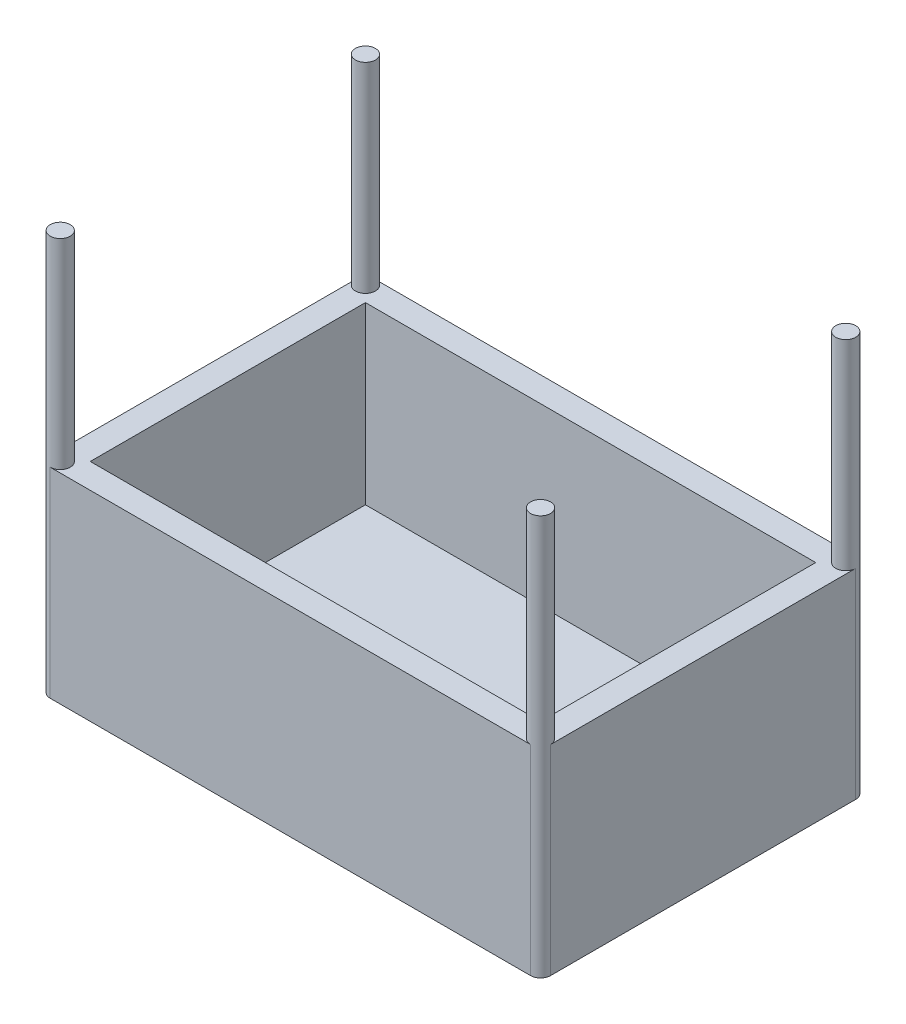
ISO-10303-21;
HEADER;
FILE_DESCRIPTION(('STEP AP214'),'2;1');
FILE_NAME('part.step','',(''),(''),'','','');
FILE_SCHEMA(('AUTOMOTIVE_DESIGN { 1 0 10303 214 1 1 1 1 }'));
ENDSEC;
DATA;
#1=APPLICATION_CONTEXT('core data for automotive mechanical design processes');
#2=APPLICATION_PROTOCOL_DEFINITION('international standard','automotive_design',2000,#1);
#3=PRODUCT_CONTEXT('',#1,'mechanical');
#4=PRODUCT('Part','Part','',(#3));
#5=PRODUCT_RELATED_PRODUCT_CATEGORY('part','',(#4));
#6=PRODUCT_DEFINITION_FORMATION('','',#4);
#7=PRODUCT_DEFINITION_CONTEXT('part definition',#1,'design');
#8=PRODUCT_DEFINITION('design','',#6,#7);
#9=PRODUCT_DEFINITION_SHAPE('','',#8);
#10=(LENGTH_UNIT() NAMED_UNIT(*) SI_UNIT(.MILLI.,.METRE.));
#11=(NAMED_UNIT(*) PLANE_ANGLE_UNIT() SI_UNIT($,.RADIAN.));
#12=(NAMED_UNIT(*) SI_UNIT($,.STERADIAN.) SOLID_ANGLE_UNIT());
#13=UNCERTAINTY_MEASURE_WITH_UNIT(LENGTH_MEASURE(1.E-05),#10,'distance_accuracy_value','');
#14=(GEOMETRIC_REPRESENTATION_CONTEXT(3) GLOBAL_UNCERTAINTY_ASSIGNED_CONTEXT((#13)) GLOBAL_UNIT_ASSIGNED_CONTEXT((#10,
#11,#12)) REPRESENTATION_CONTEXT('',''));
#15=CARTESIAN_POINT('',(0.,0.,0.));
#16=DIRECTION('',(0.,0.,1.));
#17=DIRECTION('',(1.,0.,0.));
#18=AXIS2_PLACEMENT_3D('',#15,#16,#17);
#19=CARTESIAN_POINT('',(0.,40.,0.));
#20=DIRECTION('',(0.,1.,0.));
#21=DIRECTION('',(0.,0.,1.));
#22=AXIS2_PLACEMENT_3D('',#19,#20,#21);
#23=PLANE('',#22);
#24=DIRECTION('',(0.,0.,1.));
#25=VECTOR('',#24,1.);
#26=CARTESIAN_POINT('',(50.9322033898305,40.,-28.0007704160247));
#27=LINE('',#26,#25);
#28=CARTESIAN_POINT('',(50.9322033898305,40.,-28.0007704160247));
#29=VERTEX_POINT('',#28);
#30=CARTESIAN_POINT('',(50.9322033898305,40.,26.9992295839753));
#31=VERTEX_POINT('',#30);
#32=EDGE_CURVE('E180',#29,#31,#27,.T.);
#33=ORIENTED_EDGE('',*,*,#32,.T.);
#34=DIRECTION('',(-1.,0.,0.));
#35=VECTOR('',#34,1.);
#36=CARTESIAN_POINT('',(-39.0677966101695,40.,26.9992295839753));
#37=LINE('',#36,#35);
#38=CARTESIAN_POINT('',(-39.0677966101695,40.,26.9992295839753));
#39=VERTEX_POINT('',#38);
#40=EDGE_CURVE('E177',#31,#39,#37,.T.);
#41=ORIENTED_EDGE('',*,*,#40,.T.);
#42=DIRECTION('',(0.,0.,-1.));
#43=VECTOR('',#42,1.);
#44=CARTESIAN_POINT('',(-39.0677966101695,40.,-28.0007704160247));
#45=LINE('',#44,#43);
#46=CARTESIAN_POINT('',(-39.0677966101695,40.,-28.0007704160247));
#47=VERTEX_POINT('',#46);
#48=EDGE_CURVE('E186',#39,#47,#45,.T.);
#49=ORIENTED_EDGE('',*,*,#48,.T.);
#50=DIRECTION('',(1.,0.,0.));
#51=VECTOR('',#50,1.);
#52=CARTESIAN_POINT('',(-39.0677966101695,40.,-28.0007704160247));
#53=LINE('',#52,#51);
#54=EDGE_CURVE('E183',#47,#29,#53,.T.);
#55=ORIENTED_EDGE('',*,*,#54,.T.);
#56=EDGE_LOOP('',(#33,#41,#49,#55));
#57=FACE_BOUND('',#56,.T.);
#58=DIRECTION('',(1.,0.,0.));
#59=VECTOR('',#58,1.);
#60=CARTESIAN_POINT('',(-44.0677966101695,40.,31.9992295839753));
#61=LINE('',#60,#59);
#62=CARTESIAN_POINT('',(-42.0677966101695,40.,31.9992295839753));
#63=VERTEX_POINT('',#62);
#64=CARTESIAN_POINT('',(53.9322033898305,40.,31.9992295839753));
#65=VERTEX_POINT('',#64);
#66=EDGE_CURVE('E189',#63,#65,#61,.T.);
#67=ORIENTED_EDGE('',*,*,#66,.T.);
#68=CARTESIAN_POINT('',(53.9322033898305,40.,29.9992295839753));
#69=DIRECTION('',(0.,1.,0.));
#70=DIRECTION('',(0.,0.,1.));
#71=AXIS2_PLACEMENT_3D('',#68,#69,#70);
#72=CIRCLE('',#71,2.);
#73=CARTESIAN_POINT('',(55.9322033898305,40.,29.9992295839753));
#74=VERTEX_POINT('',#73);
#75=EDGE_CURVE('E171',#65,#74,#72,.F.);
#76=ORIENTED_EDGE('',*,*,#75,.T.);
#77=DIRECTION('',(0.,0.,1.));
#78=VECTOR('',#77,1.);
#79=CARTESIAN_POINT('',(55.9322033898305,40.,29.9992295839753));
#80=LINE('',#79,#78);
#81=CARTESIAN_POINT('',(55.9322033898305,40.,-31.0007704160247));
#82=VERTEX_POINT('',#81);
#83=EDGE_CURVE('E163',#82,#74,#80,.T.);
#84=ORIENTED_EDGE('',*,*,#83,.F.);
#85=CARTESIAN_POINT('',(53.9322033898305,40.,-31.0007704160247));
#86=DIRECTION('',(0.,1.,0.));
#87=DIRECTION('',(0.,0.,1.));
#88=AXIS2_PLACEMENT_3D('',#85,#86,#87);
#89=CIRCLE('',#88,2.);
#90=CARTESIAN_POINT('',(53.9322033898305,40.,-33.0007704160247));
#91=VERTEX_POINT('',#90);
#92=EDGE_CURVE('E174',#82,#91,#89,.F.);
#93=ORIENTED_EDGE('',*,*,#92,.T.);
#94=DIRECTION('',(-1.,0.,0.));
#95=VECTOR('',#94,1.);
#96=CARTESIAN_POINT('',(-44.0677966101695,40.,-33.0007704160247));
#97=LINE('',#96,#95);
#98=CARTESIAN_POINT('',(-42.0677966101695,40.,-33.0007704160247));
#99=VERTEX_POINT('',#98);
#100=EDGE_CURVE('E192',#91,#99,#97,.T.);
#101=ORIENTED_EDGE('',*,*,#100,.T.);
#102=CARTESIAN_POINT('',(-42.0677966101695,40.,-31.0007704160247));
#103=DIRECTION('',(0.,1.,0.));
#104=DIRECTION('',(0.,0.,1.));
#105=AXIS2_PLACEMENT_3D('',#102,#103,#104);
#106=CIRCLE('',#105,2.);
#107=CARTESIAN_POINT('',(-44.0677966101695,40.,-31.0007704160247));
#108=VERTEX_POINT('',#107);
#109=EDGE_CURVE('E122',#99,#108,#106,.F.);
#110=ORIENTED_EDGE('',*,*,#109,.T.);
#111=DIRECTION('',(0.,0.,1.));
#112=VECTOR('',#111,1.);
#113=CARTESIAN_POINT('',(-44.0677966101695,40.,-33.0007704160247));
#114=LINE('',#113,#112);
#115=CARTESIAN_POINT('',(-44.0677966101695,40.,29.9992295839753));
#116=VERTEX_POINT('',#115);
#117=EDGE_CURVE('E194',#108,#116,#114,.T.);
#118=ORIENTED_EDGE('',*,*,#117,.T.);
#119=CARTESIAN_POINT('',(-42.0677966101695,40.,29.9992295839753));
#120=DIRECTION('',(0.,1.,0.));
#121=DIRECTION('',(0.,0.,1.));
#122=AXIS2_PLACEMENT_3D('',#119,#120,#121);
#123=CIRCLE('',#122,2.);
#124=EDGE_CURVE('E168',#116,#63,#123,.F.);
#125=ORIENTED_EDGE('',*,*,#124,.T.);
#126=EDGE_LOOP('',(#67,#76,#84,#93,#101,#110,#118,#125));
#127=FACE_BOUND('',#126,.T.);
#128=ADVANCED_FACE('F32',(#57,#127),#23,.T.);
#129=CARTESIAN_POINT('',(-44.0677966101695,80.,31.9992295839753));
#130=DIRECTION('',(0.,0.,-1.));
#131=DIRECTION('',(-1.,0.,0.));
#132=AXIS2_PLACEMENT_3D('',#129,#130,#131);
#133=PLANE('',#132);
#134=ORIENTED_EDGE('',*,*,#66,.F.);
#135=DIRECTION('',(0.,1.,0.));
#136=VECTOR('',#135,1.);
#137=CARTESIAN_POINT('',(-42.0677966101695,-0.00999999999999612,31.9992295839753));
#138=LINE('',#137,#136);
#139=CARTESIAN_POINT('',(-42.0677966101695,0.,31.9992295839753));
#140=VERTEX_POINT('',#139);
#141=EDGE_CURVE('E213',#140,#63,#138,.T.);
#142=ORIENTED_EDGE('',*,*,#141,.F.);
#143=DIRECTION('',(1.,0.,0.));
#144=VECTOR('',#143,1.);
#145=CARTESIAN_POINT('',(-44.0677966101695,0.,31.9992295839753));
#146=LINE('',#145,#144);
#147=CARTESIAN_POINT('',(53.9322033898305,0.,31.9992295839753));
#148=VERTEX_POINT('',#147);
#149=EDGE_CURVE('E146',#140,#148,#146,.T.);
#150=ORIENTED_EDGE('',*,*,#149,.T.);
#151=DIRECTION('',(0.,1.,0.));
#152=VECTOR('',#151,1.);
#153=CARTESIAN_POINT('',(53.9322033898305,-0.00999999999999612,31.9992295839753));
#154=LINE('',#153,#152);
#155=EDGE_CURVE('E205',#148,#65,#154,.T.);
#156=ORIENTED_EDGE('',*,*,#155,.T.);
#157=EDGE_LOOP('',(#134,#142,#150,#156));
#158=FACE_BOUND('',#157,.T.);
#159=ADVANCED_FACE('F227',(#158),#133,.F.);
#160=CARTESIAN_POINT('',(-44.0677966101695,80.,-33.0007704160247));
#161=DIRECTION('',(0.,0.,1.));
#162=DIRECTION('',(1.,0.,0.));
#163=AXIS2_PLACEMENT_3D('',#160,#161,#162);
#164=PLANE('',#163);
#165=ORIENTED_EDGE('',*,*,#100,.F.);
#166=DIRECTION('',(0.,1.,0.));
#167=VECTOR('',#166,1.);
#168=CARTESIAN_POINT('',(53.9322033898305,-0.00999999999999612,-33.0007704160247));
#169=LINE('',#168,#167);
#170=CARTESIAN_POINT('',(53.9322033898305,0.,-33.0007704160247));
#171=VERTEX_POINT('',#170);
#172=EDGE_CURVE('E11',#171,#91,#169,.T.);
#173=ORIENTED_EDGE('',*,*,#172,.F.);
#174=DIRECTION('',(-1.,0.,0.));
#175=VECTOR('',#174,1.);
#176=CARTESIAN_POINT('',(-44.0677966101695,0.,-33.0007704160247));
#177=LINE('',#176,#175);
#178=CARTESIAN_POINT('',(-42.0677966101695,0.,-33.0007704160247));
#179=VERTEX_POINT('',#178);
#180=EDGE_CURVE('E128',#171,#179,#177,.T.);
#181=ORIENTED_EDGE('',*,*,#180,.T.);
#182=DIRECTION('',(0.,1.,0.));
#183=VECTOR('',#182,1.);
#184=CARTESIAN_POINT('',(-42.0677966101695,-0.00999999999999612,-33.0007704160247));
#185=LINE('',#184,#183);
#186=EDGE_CURVE('E116',#179,#99,#185,.T.);
#187=ORIENTED_EDGE('',*,*,#186,.T.);
#188=EDGE_LOOP('',(#165,#173,#181,#187));
#189=FACE_BOUND('',#188,.T.);
#190=ADVANCED_FACE('F142',(#189),#164,.F.);
#191=CARTESIAN_POINT('',(-44.0677966101695,80.,-33.0007704160247));
#192=DIRECTION('',(1.,0.,0.));
#193=DIRECTION('',(0.,0.,-1.));
#194=AXIS2_PLACEMENT_3D('',#191,#192,#193);
#195=PLANE('',#194);
#196=ORIENTED_EDGE('',*,*,#117,.F.);
#197=DIRECTION('',(0.,1.,0.));
#198=VECTOR('',#197,1.);
#199=CARTESIAN_POINT('',(-44.0677966101695,-0.00999999999999612,-31.0007704160247));
#200=LINE('',#199,#198);
#201=CARTESIAN_POINT('',(-44.0677966101695,0.,-31.0007704160247));
#202=VERTEX_POINT('',#201);
#203=EDGE_CURVE('E211',#202,#108,#200,.T.);
#204=ORIENTED_EDGE('',*,*,#203,.F.);
#205=DIRECTION('',(0.,0.,1.));
#206=VECTOR('',#205,1.);
#207=CARTESIAN_POINT('',(-44.0677966101695,0.,-33.0007704160247));
#208=LINE('',#207,#206);
#209=CARTESIAN_POINT('',(-44.0677966101695,0.,29.9992295839753));
#210=VERTEX_POINT('',#209);
#211=EDGE_CURVE('E137',#202,#210,#208,.T.);
#212=ORIENTED_EDGE('',*,*,#211,.T.);
#213=DIRECTION('',(0.,1.,0.));
#214=VECTOR('',#213,1.);
#215=CARTESIAN_POINT('',(-44.0677966101695,-0.00999999999999612,29.9992295839753));
#216=LINE('',#215,#214);
#217=EDGE_CURVE('E208',#210,#116,#216,.T.);
#218=ORIENTED_EDGE('',*,*,#217,.T.);
#219=EDGE_LOOP('',(#196,#204,#212,#218));
#220=FACE_BOUND('',#219,.T.);
#221=ADVANCED_FACE('F34',(#220),#195,.F.);
#222=CARTESIAN_POINT('',(0.,0.,0.));
#223=DIRECTION('',(0.,1.,0.));
#224=DIRECTION('',(0.,0.,1.));
#225=AXIS2_PLACEMENT_3D('',#222,#223,#224);
#226=PLANE('',#225);
#227=ORIENTED_EDGE('',*,*,#211,.F.);
#228=CARTESIAN_POINT('',(-42.0677966101695,0.,-31.0007704160247));
#229=DIRECTION('',(0.,1.,0.));
#230=DIRECTION('',(0.,0.,1.));
#231=AXIS2_PLACEMENT_3D('',#228,#229,#230);
#232=CIRCLE('',#231,2.);
#233=EDGE_CURVE('E119',#179,#202,#232,.T.);
#234=ORIENTED_EDGE('',*,*,#233,.F.);
#235=ORIENTED_EDGE('',*,*,#180,.F.);
#236=CARTESIAN_POINT('',(53.9322033898305,0.,-31.0007704160247));
#237=DIRECTION('',(0.,1.,0.));
#238=DIRECTION('',(0.,0.,1.));
#239=AXIS2_PLACEMENT_3D('',#236,#237,#238);
#240=CIRCLE('',#239,2.);
#241=CARTESIAN_POINT('',(55.9322033898305,0.,-31.0007704160247));
#242=VERTEX_POINT('',#241);
#243=EDGE_CURVE('E150',#242,#171,#240,.T.);
#244=ORIENTED_EDGE('',*,*,#243,.F.);
#245=DIRECTION('',(0.,0.,-1.));
#246=VECTOR('',#245,1.);
#247=CARTESIAN_POINT('',(55.9322033898305,0.,-33.0007704160247));
#248=LINE('',#247,#246);
#249=CARTESIAN_POINT('',(55.9322033898305,0.,29.9992295839753));
#250=VERTEX_POINT('',#249);
#251=EDGE_CURVE('E143',#250,#242,#248,.T.);
#252=ORIENTED_EDGE('',*,*,#251,.F.);
#253=CARTESIAN_POINT('',(53.9322033898305,0.,29.9992295839753));
#254=DIRECTION('',(0.,1.,0.));
#255=DIRECTION('',(0.,0.,1.));
#256=AXIS2_PLACEMENT_3D('',#253,#254,#255);
#257=CIRCLE('',#256,2.);
#258=EDGE_CURVE('E218',#148,#250,#257,.T.);
#259=ORIENTED_EDGE('',*,*,#258,.F.);
#260=ORIENTED_EDGE('',*,*,#149,.F.);
#261=CARTESIAN_POINT('',(-42.0677966101695,0.,29.9992295839753));
#262=DIRECTION('',(0.,1.,0.));
#263=DIRECTION('',(0.,0.,1.));
#264=AXIS2_PLACEMENT_3D('',#261,#262,#263);
#265=CIRCLE('',#264,2.);
#266=EDGE_CURVE('E138',#210,#140,#265,.T.);
#267=ORIENTED_EDGE('',*,*,#266,.F.);
#268=EDGE_LOOP('',(#227,#234,#235,#244,#252,#259,#260,#267));
#269=FACE_BOUND('',#268,.T.);
#270=ADVANCED_FACE('F133',(#269),#226,.F.);
#271=CARTESIAN_POINT('',(55.9322033898305,80.,-33.0007704160247));
#272=DIRECTION('',(-1.,0.,0.));
#273=DIRECTION('',(0.,0.,1.));
#274=AXIS2_PLACEMENT_3D('',#271,#272,#273);
#275=PLANE('',#274);
#276=DIRECTION('',(0.,1.,0.));
#277=VECTOR('',#276,1.);
#278=CARTESIAN_POINT('',(55.9322033898305,-0.00999999999999612,-31.0007704160247));
#279=LINE('',#278,#277);
#280=EDGE_CURVE('E127',#242,#82,#279,.T.);
#281=ORIENTED_EDGE('',*,*,#280,.T.);
#282=ORIENTED_EDGE('',*,*,#83,.T.);
#283=DIRECTION('',(0.,1.,0.));
#284=VECTOR('',#283,1.);
#285=CARTESIAN_POINT('',(55.9322033898305,-0.00999999999999612,29.9992295839753));
#286=LINE('',#285,#284);
#287=EDGE_CURVE('E41',#250,#74,#286,.T.);
#288=ORIENTED_EDGE('',*,*,#287,.F.);
#289=ORIENTED_EDGE('',*,*,#251,.T.);
#290=EDGE_LOOP('',(#281,#282,#288,#289));
#291=FACE_BOUND('',#290,.T.);
#292=ADVANCED_FACE('F222',(#291),#275,.F.);
#293=CARTESIAN_POINT('',(-39.0677966101695,-175.475115548645,26.9992295839753));
#294=DIRECTION('',(0.,0.,1.));
#295=DIRECTION('',(1.,0.,0.));
#296=AXIS2_PLACEMENT_3D('',#293,#294,#295);
#297=PLANE('',#296);
#298=ORIENTED_EDGE('',*,*,#40,.F.);
#299=DIRECTION('',(0.,1.,0.));
#300=VECTOR('',#299,1.);
#301=CARTESIAN_POINT('',(50.9322033898305,-175.475115548645,26.9992295839753));
#302=LINE('',#301,#300);
#303=CARTESIAN_POINT('',(50.9322033898305,5.,26.9992295839753));
#304=VERTEX_POINT('',#303);
#305=EDGE_CURVE('E198',#304,#31,#302,.T.);
#306=ORIENTED_EDGE('',*,*,#305,.F.);
#307=DIRECTION('',(-1.,0.,0.));
#308=VECTOR('',#307,1.);
#309=CARTESIAN_POINT('',(-39.0677966101695,5.,26.9992295839753));
#310=LINE('',#309,#308);
#311=CARTESIAN_POINT('',(-39.0677966101695,5.,26.9992295839753));
#312=VERTEX_POINT('',#311);
#313=EDGE_CURVE('E153',#304,#312,#310,.T.);
#314=ORIENTED_EDGE('',*,*,#313,.T.);
#315=DIRECTION('',(0.,1.,0.));
#316=VECTOR('',#315,1.);
#317=CARTESIAN_POINT('',(-39.0677966101695,-175.475115548645,26.9992295839753));
#318=LINE('',#317,#316);
#319=EDGE_CURVE('E166',#312,#39,#318,.T.);
#320=ORIENTED_EDGE('',*,*,#319,.T.);
#321=EDGE_LOOP('',(#298,#306,#314,#320));
#322=FACE_BOUND('',#321,.T.);
#323=ADVANCED_FACE('F259',(#322),#297,.F.);
#324=CARTESIAN_POINT('',(50.9322033898305,-175.475115548645,-28.0007704160247));
#325=DIRECTION('',(1.,0.,0.));
#326=DIRECTION('',(0.,0.,-1.));
#327=AXIS2_PLACEMENT_3D('',#324,#325,#326);
#328=PLANE('',#327);
#329=ORIENTED_EDGE('',*,*,#32,.F.);
#330=DIRECTION('',(0.,1.,0.));
#331=VECTOR('',#330,1.);
#332=CARTESIAN_POINT('',(50.9322033898305,-175.475115548645,-28.0007704160247));
#333=LINE('',#332,#331);
#334=CARTESIAN_POINT('',(50.9322033898305,5.,-28.0007704160247));
#335=VERTEX_POINT('',#334);
#336=EDGE_CURVE('E200',#335,#29,#333,.T.);
#337=ORIENTED_EDGE('',*,*,#336,.F.);
#338=DIRECTION('',(0.,0.,1.));
#339=VECTOR('',#338,1.);
#340=CARTESIAN_POINT('',(50.9322033898305,5.,-28.0007704160247));
#341=LINE('',#340,#339);
#342=EDGE_CURVE('E156',#335,#304,#341,.T.);
#343=ORIENTED_EDGE('',*,*,#342,.T.);
#344=ORIENTED_EDGE('',*,*,#305,.T.);
#345=EDGE_LOOP('',(#329,#337,#343,#344));
#346=FACE_BOUND('',#345,.T.);
#347=ADVANCED_FACE('F266',(#346),#328,.F.);
#348=CARTESIAN_POINT('',(-39.0677966101695,-175.475115548645,-28.0007704160247));
#349=DIRECTION('',(0.,0.,-1.));
#350=DIRECTION('',(-1.,0.,0.));
#351=AXIS2_PLACEMENT_3D('',#348,#349,#350);
#352=PLANE('',#351);
#353=ORIENTED_EDGE('',*,*,#54,.F.);
#354=DIRECTION('',(0.,1.,0.));
#355=VECTOR('',#354,1.);
#356=CARTESIAN_POINT('',(-39.0677966101695,-175.475115548645,-28.0007704160247));
#357=LINE('',#356,#355);
#358=CARTESIAN_POINT('',(-39.0677966101695,5.,-28.0007704160247));
#359=VERTEX_POINT('',#358);
#360=EDGE_CURVE('E158',#359,#47,#357,.T.);
#361=ORIENTED_EDGE('',*,*,#360,.F.);
#362=DIRECTION('',(1.,0.,0.));
#363=VECTOR('',#362,1.);
#364=CARTESIAN_POINT('',(-39.0677966101695,5.,-28.0007704160247));
#365=LINE('',#364,#363);
#366=EDGE_CURVE('E47',#359,#335,#365,.T.);
#367=ORIENTED_EDGE('',*,*,#366,.T.);
#368=ORIENTED_EDGE('',*,*,#336,.T.);
#369=EDGE_LOOP('',(#353,#361,#367,#368));
#370=FACE_BOUND('',#369,.T.);
#371=ADVANCED_FACE('F285',(#370),#352,.F.);
#372=CARTESIAN_POINT('',(-39.0677966101695,-175.475115548645,-28.0007704160247));
#373=DIRECTION('',(-1.,0.,0.));
#374=DIRECTION('',(0.,0.,1.));
#375=AXIS2_PLACEMENT_3D('',#372,#373,#374);
#376=PLANE('',#375);
#377=ORIENTED_EDGE('',*,*,#48,.F.);
#378=ORIENTED_EDGE('',*,*,#319,.F.);
#379=DIRECTION('',(0.,0.,-1.));
#380=VECTOR('',#379,1.);
#381=CARTESIAN_POINT('',(-39.0677966101695,5.,-28.0007704160247));
#382=LINE('',#381,#380);
#383=EDGE_CURVE('E160',#312,#359,#382,.T.);
#384=ORIENTED_EDGE('',*,*,#383,.T.);
#385=ORIENTED_EDGE('',*,*,#360,.T.);
#386=EDGE_LOOP('',(#377,#378,#384,#385));
#387=FACE_BOUND('',#386,.T.);
#388=ADVANCED_FACE('F283',(#387),#376,.F.);
#389=CARTESIAN_POINT('',(0.,5.,0.));
#390=DIRECTION('',(0.,1.,0.));
#391=DIRECTION('',(0.,0.,1.));
#392=AXIS2_PLACEMENT_3D('',#389,#390,#391);
#393=PLANE('',#392);
#394=ORIENTED_EDGE('',*,*,#383,.F.);
#395=ORIENTED_EDGE('',*,*,#313,.F.);
#396=ORIENTED_EDGE('',*,*,#342,.F.);
#397=ORIENTED_EDGE('',*,*,#366,.F.);
#398=EDGE_LOOP('',(#394,#395,#396,#397));
#399=FACE_BOUND('',#398,.T.);
#400=ADVANCED_FACE('F281',(#399),#393,.T.);
#401=CARTESIAN_POINT('',(53.9322033898305,-0.00999999999999612,-31.0007704160247));
#402=DIRECTION('',(0.,1.,0.));
#403=DIRECTION('',(0.,0.,1.));
#404=AXIS2_PLACEMENT_3D('',#401,#402,#403);
#405=CYLINDRICAL_SURFACE('',#404,2.);
#406=CARTESIAN_POINT('',(53.9322033898305,80.,-31.0007704160247));
#407=DIRECTION('',(0.,1.,0.));
#408=DIRECTION('',(0.,0.,1.));
#409=AXIS2_PLACEMENT_3D('',#406,#407,#408);
#410=CIRCLE('',#409,2.);
#411=CARTESIAN_POINT('',(53.9322033898305,80.,-29.0007704160246));
#412=VERTEX_POINT('',#411);
#413=EDGE_CURVE('E229',#412,#412,#410,.T.);
#414=ORIENTED_EDGE('',*,*,#413,.F.);
#415=EDGE_LOOP('',(#414));
#416=FACE_BOUND('',#415,.T.);
#417=ORIENTED_EDGE('',*,*,#280,.F.);
#418=ORIENTED_EDGE('',*,*,#243,.T.);
#419=ORIENTED_EDGE('',*,*,#172,.T.);
#420=ORIENTED_EDGE('',*,*,#92,.F.);
#421=EDGE_LOOP('',(#417,#418,#419,#420));
#422=FACE_BOUND('',#421,.T.);
#423=ADVANCED_FACE('F280',(#416,#422),#405,.T.);
#424=CARTESIAN_POINT('',(0.,80.,0.));
#425=DIRECTION('',(0.,1.,0.));
#426=DIRECTION('',(0.,0.,1.));
#427=AXIS2_PLACEMENT_3D('',#424,#425,#426);
#428=PLANE('',#427);
#429=ORIENTED_EDGE('',*,*,#413,.T.);
#430=EDGE_LOOP('',(#429));
#431=FACE_BOUND('',#430,.T.);
#432=ADVANCED_FACE('F311',(#431),#428,.T.);
#433=CARTESIAN_POINT('',(53.9322033898305,-0.00999999999999612,29.9992295839753));
#434=DIRECTION('',(0.,1.,0.));
#435=DIRECTION('',(0.,0.,1.));
#436=AXIS2_PLACEMENT_3D('',#433,#434,#435);
#437=CYLINDRICAL_SURFACE('',#436,2.);
#438=CARTESIAN_POINT('',(53.9322033898305,80.,29.9992295839753));
#439=DIRECTION('',(0.,1.,0.));
#440=DIRECTION('',(0.,0.,1.));
#441=AXIS2_PLACEMENT_3D('',#438,#439,#440);
#442=CIRCLE('',#441,2.);
#443=CARTESIAN_POINT('',(53.9322033898305,80.,31.9992295839753));
#444=VERTEX_POINT('',#443);
#445=EDGE_CURVE('E230',#444,#444,#442,.T.);
#446=ORIENTED_EDGE('',*,*,#445,.F.);
#447=EDGE_LOOP('',(#446));
#448=FACE_BOUND('',#447,.T.);
#449=ORIENTED_EDGE('',*,*,#155,.F.);
#450=ORIENTED_EDGE('',*,*,#258,.T.);
#451=ORIENTED_EDGE('',*,*,#287,.T.);
#452=ORIENTED_EDGE('',*,*,#75,.F.);
#453=EDGE_LOOP('',(#449,#450,#451,#452));
#454=FACE_BOUND('',#453,.T.);
#455=ADVANCED_FACE('F216',(#448,#454),#437,.T.);
#456=CARTESIAN_POINT('',(0.,80.,0.));
#457=DIRECTION('',(0.,1.,0.));
#458=DIRECTION('',(0.,0.,1.));
#459=AXIS2_PLACEMENT_3D('',#456,#457,#458);
#460=PLANE('',#459);
#461=ORIENTED_EDGE('',*,*,#445,.T.);
#462=EDGE_LOOP('',(#461));
#463=FACE_BOUND('',#462,.T.);
#464=ADVANCED_FACE('F320',(#463),#460,.T.);
#465=CARTESIAN_POINT('',(-42.0677966101695,-0.00999999999999612,29.9992295839753));
#466=DIRECTION('',(0.,1.,0.));
#467=DIRECTION('',(0.,0.,1.));
#468=AXIS2_PLACEMENT_3D('',#465,#466,#467);
#469=CYLINDRICAL_SURFACE('',#468,2.);
#470=CARTESIAN_POINT('',(-42.0677966101695,80.,29.9992295839753));
#471=DIRECTION('',(0.,1.,0.));
#472=DIRECTION('',(0.,0.,1.));
#473=AXIS2_PLACEMENT_3D('',#470,#471,#472);
#474=CIRCLE('',#473,2.);
#475=CARTESIAN_POINT('',(-42.0677966101695,80.,31.9992295839753));
#476=VERTEX_POINT('',#475);
#477=EDGE_CURVE('E234',#476,#476,#474,.T.);
#478=ORIENTED_EDGE('',*,*,#477,.F.);
#479=EDGE_LOOP('',(#478));
#480=FACE_BOUND('',#479,.T.);
#481=ORIENTED_EDGE('',*,*,#217,.F.);
#482=ORIENTED_EDGE('',*,*,#266,.T.);
#483=ORIENTED_EDGE('',*,*,#141,.T.);
#484=ORIENTED_EDGE('',*,*,#124,.F.);
#485=EDGE_LOOP('',(#481,#482,#483,#484));
#486=FACE_BOUND('',#485,.T.);
#487=ADVANCED_FACE('F255',(#480,#486),#469,.T.);
#488=CARTESIAN_POINT('',(0.,80.,0.));
#489=DIRECTION('',(0.,1.,0.));
#490=DIRECTION('',(0.,0.,1.));
#491=AXIS2_PLACEMENT_3D('',#488,#489,#490);
#492=PLANE('',#491);
#493=ORIENTED_EDGE('',*,*,#477,.T.);
#494=EDGE_LOOP('',(#493));
#495=FACE_BOUND('',#494,.T.);
#496=ADVANCED_FACE('F246',(#495),#492,.T.);
#497=CARTESIAN_POINT('',(-42.0677966101695,-0.00999999999999612,-31.0007704160247));
#498=DIRECTION('',(0.,1.,0.));
#499=DIRECTION('',(0.,0.,1.));
#500=AXIS2_PLACEMENT_3D('',#497,#498,#499);
#501=CYLINDRICAL_SURFACE('',#500,2.);
#502=CARTESIAN_POINT('',(-42.0677966101695,80.,-31.0007704160247));
#503=DIRECTION('',(0.,1.,0.));
#504=DIRECTION('',(0.,0.,1.));
#505=AXIS2_PLACEMENT_3D('',#502,#503,#504);
#506=CIRCLE('',#505,2.);
#507=CARTESIAN_POINT('',(-42.0677966101695,80.,-29.0007704160246));
#508=VERTEX_POINT('',#507);
#509=EDGE_CURVE('E139',#508,#508,#506,.T.);
#510=ORIENTED_EDGE('',*,*,#509,.F.);
#511=EDGE_LOOP('',(#510));
#512=FACE_BOUND('',#511,.T.);
#513=ORIENTED_EDGE('',*,*,#186,.F.);
#514=ORIENTED_EDGE('',*,*,#233,.T.);
#515=ORIENTED_EDGE('',*,*,#203,.T.);
#516=ORIENTED_EDGE('',*,*,#109,.F.);
#517=EDGE_LOOP('',(#513,#514,#515,#516));
#518=FACE_BOUND('',#517,.T.);
#519=ADVANCED_FACE('F118',(#512,#518),#501,.T.);
#520=CARTESIAN_POINT('',(0.,80.,0.));
#521=DIRECTION('',(0.,1.,0.));
#522=DIRECTION('',(0.,0.,1.));
#523=AXIS2_PLACEMENT_3D('',#520,#521,#522);
#524=PLANE('',#523);
#525=ORIENTED_EDGE('',*,*,#509,.T.);
#526=EDGE_LOOP('',(#525));
#527=FACE_BOUND('',#526,.T.);
#528=ADVANCED_FACE('F243',(#527),#524,.T.);
#529=CLOSED_SHELL('',(#128,#159,#190,#221,#270,#292,#323,#347,#371,#388,#400,#423,#432,#455,
#464,#487,#496,#519,#528));
#530=MANIFOLD_SOLID_BREP('B2',#529);
#531=ADVANCED_BREP_SHAPE_REPRESENTATION('',(#18,#530),#14);
#532=SHAPE_DEFINITION_REPRESENTATION(#9,#531);
ENDSEC;
END-ISO-10303-21;
